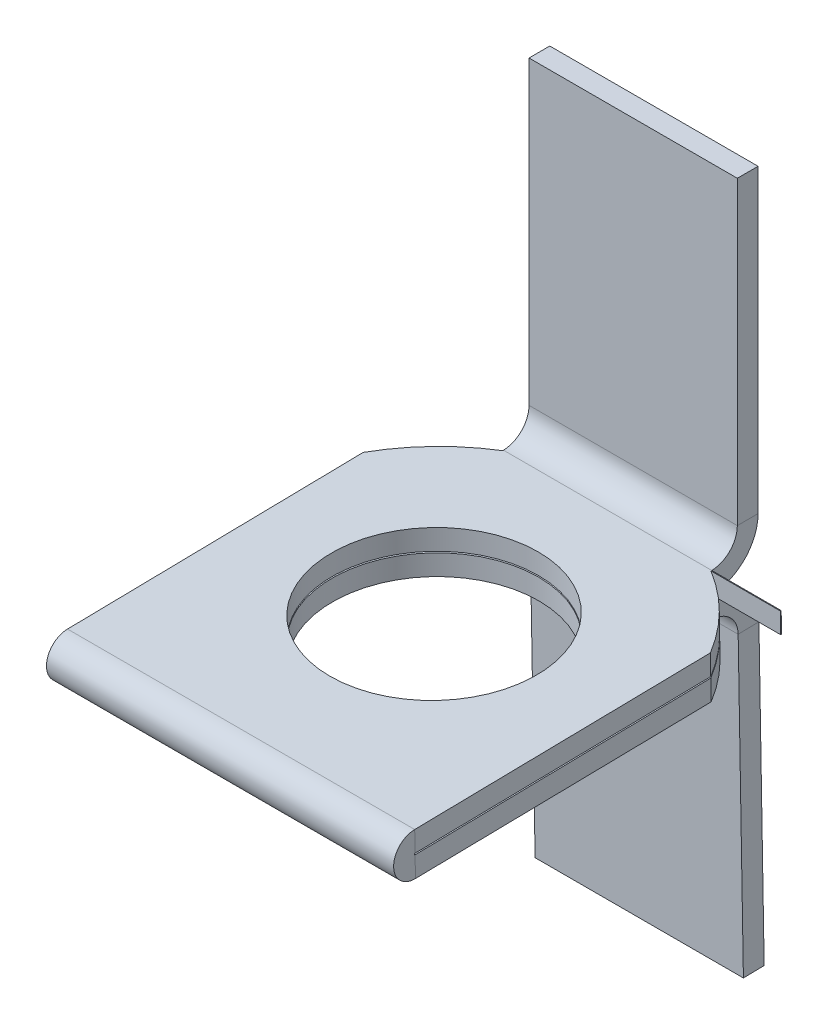
ISO-10303-21;
HEADER;
FILE_DESCRIPTION(('STEP AP214'),'2;1');
FILE_NAME('part.step','',(''),(''),'','','');
FILE_SCHEMA(('AUTOMOTIVE_DESIGN { 1 0 10303 214 1 1 1 1 }'));
ENDSEC;
DATA;
#1=APPLICATION_CONTEXT('core data for automotive mechanical design processes');
#2=APPLICATION_PROTOCOL_DEFINITION('international standard','automotive_design',2000,#1);
#3=PRODUCT_CONTEXT('',#1,'mechanical');
#4=PRODUCT('Part','Part','',(#3));
#5=PRODUCT_RELATED_PRODUCT_CATEGORY('part','',(#4));
#6=PRODUCT_DEFINITION_FORMATION('','',#4);
#7=PRODUCT_DEFINITION_CONTEXT('part definition',#1,'design');
#8=PRODUCT_DEFINITION('design','',#6,#7);
#9=PRODUCT_DEFINITION_SHAPE('','',#8);
#10=(LENGTH_UNIT() NAMED_UNIT(*) SI_UNIT(.MILLI.,.METRE.));
#11=(NAMED_UNIT(*) PLANE_ANGLE_UNIT() SI_UNIT($,.RADIAN.));
#12=(NAMED_UNIT(*) SI_UNIT($,.STERADIAN.) SOLID_ANGLE_UNIT());
#13=UNCERTAINTY_MEASURE_WITH_UNIT(LENGTH_MEASURE(1.E-05),#10,'distance_accuracy_value','');
#14=(GEOMETRIC_REPRESENTATION_CONTEXT(3) GLOBAL_UNCERTAINTY_ASSIGNED_CONTEXT((#13)) GLOBAL_UNIT_ASSIGNED_CONTEXT((#10,
#11,#12)) REPRESENTATION_CONTEXT('',''));
#15=CARTESIAN_POINT('',(0.,0.,0.));
#16=DIRECTION('',(0.,0.,1.));
#17=DIRECTION('',(1.,0.,0.));
#18=AXIS2_PLACEMENT_3D('',#15,#16,#17);
#19=CARTESIAN_POINT('',(12.7,-13.2276010571627,30.2262443212151));
#20=DIRECTION('',(-1.,0.,0.));
#21=DIRECTION('',(0.,0.,1.));
#22=AXIS2_PLACEMENT_3D('',#19,#20,#21);
#23=PLANE('',#22);
#24=DIRECTION('',(0.,-0.017452406437287,0.999847695156391));
#25=VECTOR('',#24,1.);
#26=CARTESIAN_POINT('',(12.7,-12.6956690385854,-0.248120613246977));
#27=LINE('',#26,#25);
#28=CARTESIAN_POINT('',(12.7,-12.8225975510854,7.02360899772607));
#29=VERTEX_POINT('',#28);
#30=CARTESIAN_POINT('',(12.7,-13.2002196276552,28.6575632753303));
#31=VERTEX_POINT('',#30);
#32=EDGE_CURVE('E424',#29,#31,#27,.T.);
#33=ORIENTED_EDGE('',*,*,#32,.F.);
#34=DIRECTION('',(0.,-0.999847695156391,-0.017452406437287));
#35=VECTOR('',#34,1.);
#36=CARTESIAN_POINT('',(12.7,13.0970952517496,7.4760389185191));
#37=LINE('',#36,#35);
#38=CARTESIAN_POINT('',(12.7,-11.3039088899585,7.05011780691179));
#39=VERTEX_POINT('',#38);
#40=EDGE_CURVE('E571',#39,#29,#37,.T.);
#41=ORIENTED_EDGE('',*,*,#40,.F.);
#42=DIRECTION('',(0.,0.017452406437287,-0.999847695156391));
#43=VECTOR('',#42,1.);
#44=CARTESIAN_POINT('',(12.7,-11.7089123960358,30.2527531304008));
#45=LINE('',#44,#43);
#46=CARTESIAN_POINT('',(12.7,-11.6815309665282,28.6840720845159));
#47=VERTEX_POINT('',#46);
#48=EDGE_CURVE('E322',#39,#47,#45,.F.);
#49=ORIENTED_EDGE('',*,*,#48,.T.);
#50=DIRECTION('',(0.,0.999847695156392,0.017452406437246));
#51=VECTOR('',#50,1.);
#52=CARTESIAN_POINT('',(12.7,-13.2002196276552,28.6575632753303));
#53=LINE('',#52,#51);
#54=EDGE_CURVE('E492',#31,#47,#53,.T.);
#55=ORIENTED_EDGE('',*,*,#54,.F.);
#56=EDGE_LOOP('',(#33,#41,#49,#55));
#57=FACE_BOUND('',#56,.T.);
#58=ADVANCED_FACE('F84',(#57),#23,.F.);
#59=CARTESIAN_POINT('',(-7.61999999999999,-16.2566260861431,1.84297763630703));
#60=DIRECTION('',(-1.,0.,0.));
#61=DIRECTION('',(0.,0.,1.));
#62=AXIS2_PLACEMENT_3D('',#59,#60,#61);
#63=PLANE('',#62);
#64=CARTESIAN_POINT('',(-7.61999999999999,-16.2566260861431,1.84297763630703));
#65=DIRECTION('',(1.,0.,0.));
#66=DIRECTION('',(0.,0.,-1.));
#67=AXIS2_PLACEMENT_3D('',#64,#65,#66);
#68=CIRCLE('',#67,3.42392);
#69=CARTESIAN_POINT('',(-7.61999999999999,-12.8327061245043,1.8434901702748));
#70=VERTEX_POINT('',#69);
#71=CARTESIAN_POINT('',(-7.61999999999999,-12.8332275657433,1.90273327975585));
#72=VERTEX_POINT('',#71);
#73=EDGE_CURVE('E386',#70,#72,#68,.T.);
#74=ORIENTED_EDGE('',*,*,#73,.F.);
#75=DIRECTION('',(0.,-0.999847695156391,-0.017452406437287));
#76=VECTOR('',#75,1.);
#77=CARTESIAN_POINT('',(-7.61999999999999,-16.2555921499672,1.78374347245845));
#78=LINE('',#77,#76);
#79=CARTESIAN_POINT('',(-7.61999999999999,-14.3518035687837,1.81697422575261));
#80=VERTEX_POINT('',#79);
#81=EDGE_CURVE('E13',#70,#80,#78,.T.);
#82=ORIENTED_EDGE('',*,*,#81,.T.);
#83=CARTESIAN_POINT('',(-7.61999999999999,-16.2566260861431,1.84297763630703));
#84=DIRECTION('',(-1.,0.,0.));
#85=DIRECTION('',(0.,0.,1.));
#86=AXIS2_PLACEMENT_3D('',#83,#84,#85);
#87=CIRCLE('',#86,1.905);
#88=CARTESIAN_POINT('',(-7.61999999999999,-14.3519162268702,1.8762244705701));
#89=VERTEX_POINT('',#88);
#90=EDGE_CURVE('E394',#80,#89,#87,.F.);
#91=ORIENTED_EDGE('',*,*,#90,.T.);
#92=DIRECTION('',(0.,-0.999847695156391,-0.017452406437287));
#93=VECTOR('',#92,1.);
#94=CARTESIAN_POINT('',(-7.61999999999999,-12.8332275657431,1.90273327975585));
#95=LINE('',#94,#93);
#96=EDGE_CURVE('E92',#72,#89,#95,.T.);
#97=ORIENTED_EDGE('',*,*,#96,.F.);
#98=EDGE_LOOP('',(#74,#82,#91,#97));
#99=FACE_BOUND('',#98,.T.);
#100=ADVANCED_FACE('F548',(#99),#63,.T.);
#101=CARTESIAN_POINT('',(12.7,-14.5555268208596,13.5410675878356));
#102=DIRECTION('',(-1.,0.,0.));
#103=DIRECTION('',(0.,0.017452406437287,-0.999847695156391));
#104=AXIS2_PLACEMENT_3D('',#101,#102,#103);
#105=PLANE('',#104);
#106=CARTESIAN_POINT('',(12.7,-12.922582320601,7.02186375708234));
#107=VERTEX_POINT('',#106);
#108=CARTESIAN_POINT('',(12.7,-14.441270981728,6.99535494789661));
#109=VERTEX_POINT('',#108);
#110=EDGE_CURVE('E569',#107,#109,#37,.T.);
#111=ORIENTED_EDGE('',*,*,#110,.F.);
#112=DIRECTION('',(0.,0.017452406437287,-0.999847695156391));
#113=VECTOR('',#112,1.);
#114=CARTESIAN_POINT('',(12.7,-13.0368381597327,13.5675763970213));
#115=LINE('',#114,#113);
#116=CARTESIAN_POINT('',(12.7,-13.3002043971708,28.6558180346866));
#117=VERTEX_POINT('',#116);
#118=EDGE_CURVE('E502',#117,#107,#115,.T.);
#119=ORIENTED_EDGE('',*,*,#118,.F.);
#120=DIRECTION('',(0.,-0.999847695156391,-0.017452406437287));
#121=VECTOR('',#120,1.);
#122=CARTESIAN_POINT('',(12.7,-14.8188930582977,28.6293092255009));
#123=LINE('',#122,#121);
#124=CARTESIAN_POINT('',(12.7,-14.8188930582977,28.6293092255006));
#125=VERTEX_POINT('',#124);
#126=EDGE_CURVE('E520',#117,#125,#123,.T.);
#127=ORIENTED_EDGE('',*,*,#126,.T.);
#128=DIRECTION('',(0.,0.017452406437287,-0.999847695156391));
#129=VECTOR('',#128,1.);
#130=CARTESIAN_POINT('',(12.7,-14.5555268208596,13.5410675878356));
#131=LINE('',#130,#129);
#132=EDGE_CURVE('E506',#125,#109,#131,.T.);
#133=ORIENTED_EDGE('',*,*,#132,.T.);
#134=EDGE_LOOP('',(#111,#119,#127,#133));
#135=FACE_BOUND('',#134,.T.);
#136=ADVANCED_FACE('F567',(#135),#105,.F.);
#137=CARTESIAN_POINT('',(0.,-14.5555268208596,13.5410675878355));
#138=DIRECTION('',(0.,-0.999847695156391,-0.017452406437287));
#139=DIRECTION('',(0.,0.017452406437287,-0.999847695156391));
#140=AXIS2_PLACEMENT_3D('',#137,#138,#139);
#141=PLANE('',#140);
#142=CARTESIAN_POINT('',(0.,-14.5725278524478,14.5150560352076));
#143=DIRECTION('',(0.,-0.999847695156391,-0.017452406437287));
#144=DIRECTION('',(0.,0.017452406437287,-0.999847695156391));
#145=AXIS2_PLACEMENT_3D('',#142,#143,#144);
#146=CIRCLE('',#145,14.7598486716029);
#147=CARTESIAN_POINT('',(-12.7,-14.441270981728,6.99535494789659));
#148=VERTEX_POINT('',#147);
#149=EDGE_CURVE('E308',#89,#148,#146,.F.);
#150=ORIENTED_EDGE('',*,*,#149,.F.);
#151=DIRECTION('',(-1.,0.,0.));
#152=VECTOR('',#151,1.);
#153=CARTESIAN_POINT('',(12.7,-14.3519162268702,1.87622447057007));
#154=LINE('',#153,#152);
#155=CARTESIAN_POINT('',(7.62000000000001,-14.3519162268702,1.8762244705701));
#156=VERTEX_POINT('',#155);
#157=EDGE_CURVE('E529',#156,#89,#154,.T.);
#158=ORIENTED_EDGE('',*,*,#157,.F.);
#159=CARTESIAN_POINT('',(0.,-14.5725278524478,14.5150560352076));
#160=DIRECTION('',(0.,-0.999847695156391,-0.017452406437287));
#161=DIRECTION('',(0.,0.017452406437287,-0.999847695156391));
#162=AXIS2_PLACEMENT_3D('',#159,#160,#161);
#163=CIRCLE('',#162,14.7598486716029);
#164=EDGE_CURVE('E332',#109,#156,#163,.F.);
#165=ORIENTED_EDGE('',*,*,#164,.F.);
#166=ORIENTED_EDGE('',*,*,#132,.F.);
#167=DIRECTION('',(1.,0.,0.));
#168=VECTOR('',#167,1.);
#169=CARTESIAN_POINT('',(0.,-14.8188930582977,28.6293092255009));
#170=LINE('',#169,#168);
#171=CARTESIAN_POINT('',(-12.7,-14.8188930582977,28.6293092255006));
#172=VERTEX_POINT('',#171);
#173=EDGE_CURVE('E518',#172,#125,#170,.T.);
#174=ORIENTED_EDGE('',*,*,#173,.F.);
#175=DIRECTION('',(0.,-0.017452406437287,0.999847695156391));
#176=VECTOR('',#175,1.);
#177=CARTESIAN_POINT('',(-12.7,-14.5555268208596,13.5410675878355));
#178=LINE('',#177,#176);
#179=EDGE_CURVE('E503',#148,#172,#178,.T.);
#180=ORIENTED_EDGE('',*,*,#179,.F.);
#181=EDGE_LOOP('',(#150,#158,#165,#166,#174,#180));
#182=FACE_BOUND('',#181,.T.);
#183=CARTESIAN_POINT('',(0.,-14.5725278524478,14.5150560352076));
#184=DIRECTION('',(0.,-0.999847695156391,-0.017452406437287));
#185=DIRECTION('',(0.,0.017452406437287,-0.999847695156391));
#186=AXIS2_PLACEMENT_3D('',#183,#184,#185);
#187=CIRCLE('',#186,7.62);
#188=CARTESIAN_POINT('',(0.,-14.4395405153957,6.89621659811591));
#189=VERTEX_POINT('',#188);
#190=EDGE_CURVE('E499',#189,#189,#187,.T.);
#191=ORIENTED_EDGE('',*,*,#190,.F.);
#192=EDGE_LOOP('',(#191));
#193=FACE_BOUND('',#192,.T.);
#194=ADVANCED_FACE('F543',(#182,#193),#141,.T.);
#195=CARTESIAN_POINT('',(0.,-13.0368381597327,13.5675763970213));
#196=DIRECTION('',(0.,-0.999847695156391,-0.017452406437287));
#197=DIRECTION('',(0.,0.017452406437287,-0.999847695156391));
#198=AXIS2_PLACEMENT_3D('',#195,#196,#197);
#199=PLANE('',#198);
#200=CARTESIAN_POINT('',(0.,-13.0538391913209,14.5415648443933));
#201=DIRECTION('',(0.,-0.999847695156391,-0.017452406437287));
#202=DIRECTION('',(0.,0.017452406437287,-0.999847695156391));
#203=AXIS2_PLACEMENT_3D('',#200,#201,#202);
#204=CIRCLE('',#203,7.62);
#205=CARTESIAN_POINT('',(0.,-12.9208518542687,6.92272540730164));
#206=VERTEX_POINT('',#205);
#207=EDGE_CURVE('E409',#206,#206,#204,.T.);
#208=ORIENTED_EDGE('',*,*,#207,.T.);
#209=EDGE_LOOP('',(#208));
#210=FACE_BOUND('',#209,.T.);
#211=DIRECTION('',(-1.,0.,0.));
#212=VECTOR('',#211,1.);
#213=CARTESIAN_POINT('',(12.7,-12.8332275657433,1.90273327975579));
#214=LINE('',#213,#212);
#215=CARTESIAN_POINT('',(7.62000000000001,-12.8332275657433,1.90273327975583));
#216=VERTEX_POINT('',#215);
#217=EDGE_CURVE('E523',#216,#72,#214,.T.);
#218=ORIENTED_EDGE('',*,*,#217,.T.);
#219=CARTESIAN_POINT('',(0.,-13.0538391913209,14.5415648443933));
#220=DIRECTION('',(0.,-0.999847695156391,-0.017452406437287));
#221=DIRECTION('',(0.,0.017452406437287,-0.999847695156391));
#222=AXIS2_PLACEMENT_3D('',#219,#220,#221);
#223=CIRCLE('',#222,14.7598486716029);
#224=CARTESIAN_POINT('',(-12.7,-12.922582320601,7.02186375708232));
#225=VERTEX_POINT('',#224);
#226=EDGE_CURVE('E344',#72,#225,#223,.F.);
#227=ORIENTED_EDGE('',*,*,#226,.T.);
#228=DIRECTION('',(0.,0.017452406437287,-0.999847695156391));
#229=VECTOR('',#228,1.);
#230=CARTESIAN_POINT('',(-12.7,-13.0368381597327,13.5675763970213));
#231=LINE('',#230,#229);
#232=CARTESIAN_POINT('',(-12.7,-13.3002043971708,28.6558180346866));
#233=VERTEX_POINT('',#232);
#234=EDGE_CURVE('E509',#225,#233,#231,.F.);
#235=ORIENTED_EDGE('',*,*,#234,.T.);
#236=DIRECTION('',(1.,0.,0.));
#237=VECTOR('',#236,1.);
#238=CARTESIAN_POINT('',(0.,-13.3002043971708,28.6558180346866));
#239=LINE('',#238,#237);
#240=EDGE_CURVE('E505',#233,#117,#239,.T.);
#241=ORIENTED_EDGE('',*,*,#240,.T.);
#242=ORIENTED_EDGE('',*,*,#118,.T.);
#243=CARTESIAN_POINT('',(0.,-13.0538391913209,14.5415648443933));
#244=DIRECTION('',(0.,-0.999847695156391,-0.017452406437287));
#245=DIRECTION('',(0.,0.017452406437287,-0.999847695156391));
#246=AXIS2_PLACEMENT_3D('',#243,#244,#245);
#247=CIRCLE('',#246,14.7598486716029);
#248=EDGE_CURVE('E324',#107,#216,#247,.F.);
#249=ORIENTED_EDGE('',*,*,#248,.T.);
#250=EDGE_LOOP('',(#218,#227,#235,#241,#242,#249));
#251=FACE_BOUND('',#250,.T.);
#252=ADVANCED_FACE('F563',(#210,#251),#199,.F.);
#253=CARTESIAN_POINT('',(-12.7,-14.5555268208596,13.5410675878355));
#254=DIRECTION('',(1.,0.,0.));
#255=DIRECTION('',(0.,-0.017452406437287,0.999847695156391));
#256=AXIS2_PLACEMENT_3D('',#253,#254,#255);
#257=PLANE('',#256);
#258=DIRECTION('',(0.,-0.999847695156391,-0.017452406437287));
#259=VECTOR('',#258,1.);
#260=CARTESIAN_POINT('',(-12.7,13.0970952517497,7.47603891851908));
#261=LINE('',#260,#259);
#262=EDGE_CURVE('E573',#225,#148,#261,.T.);
#263=ORIENTED_EDGE('',*,*,#262,.T.);
#264=ORIENTED_EDGE('',*,*,#179,.T.);
#265=DIRECTION('',(0.,-0.999847695156391,-0.017452406437287));
#266=VECTOR('',#265,1.);
#267=CARTESIAN_POINT('',(-12.7,-14.8188930582977,28.6293092255009));
#268=LINE('',#267,#266);
#269=EDGE_CURVE('E515',#233,#172,#268,.T.);
#270=ORIENTED_EDGE('',*,*,#269,.F.);
#271=ORIENTED_EDGE('',*,*,#234,.F.);
#272=EDGE_LOOP('',(#263,#264,#270,#271));
#273=FACE_BOUND('',#272,.T.);
#274=ADVANCED_FACE('F1002',(#273),#257,.F.);
#275=CARTESIAN_POINT('',(0.,-38.4764713832538,14.0978111488369));
#276=DIRECTION('',(0.,0.999847695156391,0.017452406437287));
#277=DIRECTION('',(0.,-0.017452406437287,0.999847695156391));
#278=AXIS2_PLACEMENT_3D('',#275,#276,#277);
#279=CYLINDRICAL_SURFACE('',#278,7.62);
#280=ORIENTED_EDGE('',*,*,#190,.T.);
#281=EDGE_LOOP('',(#280));
#282=FACE_BOUND('',#281,.T.);
#283=ORIENTED_EDGE('',*,*,#207,.F.);
#284=EDGE_LOOP('',(#283));
#285=FACE_BOUND('',#284,.T.);
#286=ADVANCED_FACE('F86',(#282,#285),#279,.F.);
#287=CARTESIAN_POINT('',(7.62,-13.4476307207564,-1.51892000000035));
#288=DIRECTION('',(-1.,0.,0.));
#289=DIRECTION('',(0.,0.,1.));
#290=AXIS2_PLACEMENT_3D('',#287,#288,#289);
#291=PLANE('',#290);
#292=DIRECTION('',(0.,0.,1.));
#293=VECTOR('',#292,1.);
#294=CARTESIAN_POINT('',(7.62,-9.30881033965216,-1.51892000000035));
#295=LINE('',#294,#293);
#296=CARTESIAN_POINT('',(7.62,-9.30881033965216,-1.51892000000035));
#297=VERTEX_POINT('',#296);
#298=CARTESIAN_POINT('',(7.62,-9.30881033965216,0.));
#299=VERTEX_POINT('',#298);
#300=EDGE_CURVE('E474',#297,#299,#295,.T.);
#301=ORIENTED_EDGE('',*,*,#300,.F.);
#302=DIRECTION('',(0.,-1.,0.));
#303=VECTOR('',#302,1.);
#304=CARTESIAN_POINT('',(7.62,-13.4476307207564,-1.51892000000035));
#305=LINE('',#304,#303);
#306=CARTESIAN_POINT('',(7.62,12.7,-1.51892000000035));
#307=VERTEX_POINT('',#306);
#308=EDGE_CURVE('E469',#307,#297,#305,.T.);
#309=ORIENTED_EDGE('',*,*,#308,.F.);
#310=DIRECTION('',(0.,0.,1.));
#311=VECTOR('',#310,1.);
#312=CARTESIAN_POINT('',(7.62,12.7,-1.51892000000035));
#313=LINE('',#312,#311);
#314=CARTESIAN_POINT('',(7.62,12.7,0.));
#315=VERTEX_POINT('',#314);
#316=EDGE_CURVE('E490',#307,#315,#313,.T.);
#317=ORIENTED_EDGE('',*,*,#316,.T.);
#318=DIRECTION('',(0.,-1.,0.));
#319=VECTOR('',#318,1.);
#320=CARTESIAN_POINT('',(7.62,9.525,0.));
#321=LINE('',#320,#319);
#322=EDGE_CURVE('E488',#315,#299,#321,.T.);
#323=ORIENTED_EDGE('',*,*,#322,.T.);
#324=EDGE_LOOP('',(#301,#309,#317,#323));
#325=FACE_BOUND('',#324,.T.);
#326=ADVANCED_FACE('F617',(#325),#291,.F.);
#327=CARTESIAN_POINT('',(-9.52499999999998,12.7,-1.51892));
#328=DIRECTION('',(0.,1.,0.));
#329=DIRECTION('',(0.,0.,1.));
#330=AXIS2_PLACEMENT_3D('',#327,#328,#329);
#331=PLANE('',#330);
#332=ORIENTED_EDGE('',*,*,#316,.F.);
#333=DIRECTION('',(-1.,0.,0.));
#334=VECTOR('',#333,1.);
#335=CARTESIAN_POINT('',(-9.52499999999998,12.7,-1.51892));
#336=LINE('',#335,#334);
#337=CARTESIAN_POINT('',(-7.62,12.7,-1.51892000000035));
#338=VERTEX_POINT('',#337);
#339=EDGE_CURVE('E485',#307,#338,#336,.T.);
#340=ORIENTED_EDGE('',*,*,#339,.T.);
#341=DIRECTION('',(0.,0.,1.));
#342=VECTOR('',#341,1.);
#343=CARTESIAN_POINT('',(-7.62,12.7,-1.51892000000035));
#344=LINE('',#343,#342);
#345=CARTESIAN_POINT('',(-7.62,12.7,0.));
#346=VERTEX_POINT('',#345);
#347=EDGE_CURVE('E482',#338,#346,#344,.T.);
#348=ORIENTED_EDGE('',*,*,#347,.T.);
#349=DIRECTION('',(-1.,0.,0.));
#350=VECTOR('',#349,1.);
#351=CARTESIAN_POINT('',(-9.52499999999998,12.7,0.));
#352=LINE('',#351,#350);
#353=EDGE_CURVE('E477',#315,#346,#352,.T.);
#354=ORIENTED_EDGE('',*,*,#353,.F.);
#355=EDGE_LOOP('',(#332,#340,#348,#354));
#356=FACE_BOUND('',#355,.T.);
#357=ADVANCED_FACE('F638',(#356),#331,.T.);
#358=CARTESIAN_POINT('',(-7.62,-13.4476307207564,-1.51892000000035));
#359=DIRECTION('',(1.,0.,0.));
#360=DIRECTION('',(0.,0.,-1.));
#361=AXIS2_PLACEMENT_3D('',#358,#359,#360);
#362=PLANE('',#361);
#363=DIRECTION('',(0.,0.,-1.));
#364=VECTOR('',#363,1.);
#365=CARTESIAN_POINT('',(-7.62,-9.30881033965216,0.));
#366=LINE('',#365,#364);
#367=CARTESIAN_POINT('',(-7.62,-9.30881033965216,0.));
#368=VERTEX_POINT('',#367);
#369=CARTESIAN_POINT('',(-7.62,-9.30881033965216,-1.51892));
#370=VERTEX_POINT('',#369);
#371=EDGE_CURVE('E455',#368,#370,#366,.T.);
#372=ORIENTED_EDGE('',*,*,#371,.F.);
#373=DIRECTION('',(0.,1.,0.));
#374=VECTOR('',#373,1.);
#375=CARTESIAN_POINT('',(-7.62,9.525,0.));
#376=LINE('',#375,#374);
#377=EDGE_CURVE('E480',#368,#346,#376,.T.);
#378=ORIENTED_EDGE('',*,*,#377,.T.);
#379=ORIENTED_EDGE('',*,*,#347,.F.);
#380=DIRECTION('',(0.,1.,0.));
#381=VECTOR('',#380,1.);
#382=CARTESIAN_POINT('',(-7.62,-13.4476307207564,-1.51892000000035));
#383=LINE('',#382,#381);
#384=EDGE_CURVE('E464',#370,#338,#383,.T.);
#385=ORIENTED_EDGE('',*,*,#384,.F.);
#386=EDGE_LOOP('',(#372,#378,#379,#385));
#387=FACE_BOUND('',#386,.T.);
#388=ADVANCED_FACE('F627',(#387),#362,.F.);
#389=CARTESIAN_POINT('',(-9.525,9.525,0.));
#390=DIRECTION('',(0.,0.,1.));
#391=DIRECTION('',(1.,0.,0.));
#392=AXIS2_PLACEMENT_3D('',#389,#390,#391);
#393=PLANE('',#392);
#394=ORIENTED_EDGE('',*,*,#322,.F.);
#395=ORIENTED_EDGE('',*,*,#353,.T.);
#396=ORIENTED_EDGE('',*,*,#377,.F.);
#397=DIRECTION('',(-1.,0.,0.));
#398=VECTOR('',#397,1.);
#399=CARTESIAN_POINT('',(12.7,-9.30881033965216,0.));
#400=LINE('',#399,#398);
#401=EDGE_CURVE('E449',#299,#368,#400,.T.);
#402=ORIENTED_EDGE('',*,*,#401,.F.);
#403=EDGE_LOOP('',(#394,#395,#396,#402));
#404=FACE_BOUND('',#403,.T.);
#405=ADVANCED_FACE('F623',(#404),#393,.T.);
#406=CARTESIAN_POINT('',(7.61999999999999,-9.30881033965216,1.905));
#407=DIRECTION('',(1.,0.,0.));
#408=DIRECTION('',(0.,1.,0.));
#409=AXIS2_PLACEMENT_3D('',#406,#407,#408);
#410=PLANE('',#409);
#411=ORIENTED_EDGE('',*,*,#300,.T.);
#412=CARTESIAN_POINT('',(7.61999999999999,-9.30881033965216,1.905));
#413=DIRECTION('',(-1.,0.,0.));
#414=DIRECTION('',(0.,0.,1.));
#415=AXIS2_PLACEMENT_3D('',#412,#413,#414);
#416=CIRCLE('',#415,1.905);
#417=CARTESIAN_POINT('',(7.62,-11.2135201989247,1.87175316573663));
#418=VERTEX_POINT('',#417);
#419=EDGE_CURVE('E471',#299,#418,#416,.T.);
#420=ORIENTED_EDGE('',*,*,#419,.T.);
#421=DIRECTION('',(0.,0.999847695156391,0.01745240643728));
#422=VECTOR('',#421,1.);
#423=CARTESIAN_POINT('',(7.62,-12.732208860052,1.84524435655091));
#424=LINE('',#423,#422);
#425=CARTESIAN_POINT('',(7.62,-12.732208860052,1.84524435655091));
#426=VERTEX_POINT('',#425);
#427=EDGE_CURVE('E440',#426,#418,#424,.T.);
#428=ORIENTED_EDGE('',*,*,#427,.F.);
#429=CARTESIAN_POINT('',(7.61999999999999,-9.30881033965216,1.905));
#430=DIRECTION('',(-1.,0.,0.));
#431=DIRECTION('',(0.,1.,0.));
#432=AXIS2_PLACEMENT_3D('',#429,#430,#431);
#433=CIRCLE('',#432,3.42392);
#434=EDGE_CURVE('E434',#297,#426,#433,.T.);
#435=ORIENTED_EDGE('',*,*,#434,.F.);
#436=EDGE_LOOP('',(#411,#420,#428,#435));
#437=FACE_BOUND('',#436,.T.);
#438=ADVANCED_FACE('F613',(#437),#410,.T.);
#439=CARTESIAN_POINT('',(-9.525,9.525,-1.51892));
#440=DIRECTION('',(0.,0.,1.));
#441=DIRECTION('',(1.,0.,0.));
#442=AXIS2_PLACEMENT_3D('',#439,#440,#441);
#443=PLANE('',#442);
#444=ORIENTED_EDGE('',*,*,#339,.F.);
#445=ORIENTED_EDGE('',*,*,#308,.T.);
#446=DIRECTION('',(-1.,0.,0.));
#447=VECTOR('',#446,1.);
#448=CARTESIAN_POINT('',(12.7,-9.30881033965216,-1.51892));
#449=LINE('',#448,#447);
#450=EDGE_CURVE('E467',#297,#370,#449,.T.);
#451=ORIENTED_EDGE('',*,*,#450,.T.);
#452=ORIENTED_EDGE('',*,*,#384,.T.);
#453=EDGE_LOOP('',(#444,#445,#451,#452));
#454=FACE_BOUND('',#453,.T.);
#455=ADVANCED_FACE('F636',(#454),#443,.F.);
#456=CARTESIAN_POINT('',(-7.62,-9.30881033965216,1.905));
#457=DIRECTION('',(-1.,0.,0.));
#458=DIRECTION('',(0.,-1.,0.));
#459=AXIS2_PLACEMENT_3D('',#456,#457,#458);
#460=PLANE('',#459);
#461=DIRECTION('',(0.,0.999847695156391,0.01745240643728));
#462=VECTOR('',#461,1.);
#463=CARTESIAN_POINT('',(-7.62,-12.732208860052,1.84524435655091));
#464=LINE('',#463,#462);
#465=CARTESIAN_POINT('',(-7.62,-12.7322088600517,1.84524435655093));
#466=VERTEX_POINT('',#465);
#467=CARTESIAN_POINT('',(-7.62,-11.2135201989247,1.87175316573666));
#468=VERTEX_POINT('',#467);
#469=EDGE_CURVE('E461',#466,#468,#464,.T.);
#470=ORIENTED_EDGE('',*,*,#469,.T.);
#471=CARTESIAN_POINT('',(-7.61999999999999,-9.30881033965216,1.905));
#472=DIRECTION('',(-1.,0.,0.));
#473=DIRECTION('',(0.,0.,1.));
#474=AXIS2_PLACEMENT_3D('',#471,#472,#473);
#475=CIRCLE('',#474,1.905);
#476=EDGE_CURVE('E458',#468,#368,#475,.F.);
#477=ORIENTED_EDGE('',*,*,#476,.T.);
#478=ORIENTED_EDGE('',*,*,#371,.T.);
#479=CARTESIAN_POINT('',(-7.62,-9.30881033965216,1.905));
#480=DIRECTION('',(1.,0.,0.));
#481=DIRECTION('',(0.,1.,0.));
#482=AXIS2_PLACEMENT_3D('',#479,#480,#481);
#483=CIRCLE('',#482,3.42392);
#484=EDGE_CURVE('E437',#466,#370,#483,.T.);
#485=ORIENTED_EDGE('',*,*,#484,.F.);
#486=EDGE_LOOP('',(#470,#477,#478,#485));
#487=FACE_BOUND('',#486,.T.);
#488=ADVANCED_FACE('F630',(#487),#460,.T.);
#489=CARTESIAN_POINT('',(15.8648842451953,-9.30881033965216,1.905));
#490=DIRECTION('',(-1.,0.,0.));
#491=DIRECTION('',(0.,0.,1.));
#492=AXIS2_PLACEMENT_3D('',#489,#490,#491);
#493=CYLINDRICAL_SURFACE('',#492,1.905);
#494=ORIENTED_EDGE('',*,*,#476,.F.);
#495=DIRECTION('',(1.,0.,0.));
#496=VECTOR('',#495,1.);
#497=CARTESIAN_POINT('',(-12.7,-11.2135201989247,1.87175316573663));
#498=LINE('',#497,#496);
#499=EDGE_CURVE('E452',#468,#418,#498,.T.);
#500=ORIENTED_EDGE('',*,*,#499,.T.);
#501=ORIENTED_EDGE('',*,*,#419,.F.);
#502=ORIENTED_EDGE('',*,*,#401,.T.);
#503=EDGE_LOOP('',(#494,#500,#501,#502));
#504=FACE_BOUND('',#503,.T.);
#505=ADVANCED_FACE('F612',(#504),#493,.F.);
#506=CARTESIAN_POINT('',(12.7,-12.732208860052,1.84524435655091));
#507=DIRECTION('',(0.,-0.01745240643728,0.999847695156391));
#508=DIRECTION('',(0.,-0.999847695156391,-0.01745240643728));
#509=AXIS2_PLACEMENT_3D('',#506,#507,#508);
#510=PLANE('',#509);
#511=DIRECTION('',(1.,0.,0.));
#512=VECTOR('',#511,1.);
#513=CARTESIAN_POINT('',(0.,-11.2135201989247,1.87175316573663));
#514=LINE('',#513,#512);
#515=CARTESIAN_POINT('',(12.7,-11.2135201989247,1.87175316573663));
#516=VERTEX_POINT('',#515);
#517=EDGE_CURVE('E447',#418,#516,#514,.T.);
#518=ORIENTED_EDGE('',*,*,#517,.T.);
#519=DIRECTION('',(0.,-0.999847695156391,-0.017452406437287));
#520=VECTOR('',#519,1.);
#521=CARTESIAN_POINT('',(12.7,-11.2135201989247,1.87175316573663));
#522=LINE('',#521,#520);
#523=CARTESIAN_POINT('',(12.7,-12.732208860052,1.84524435655091));
#524=VERTEX_POINT('',#523);
#525=EDGE_CURVE('E445',#516,#524,#522,.T.);
#526=ORIENTED_EDGE('',*,*,#525,.T.);
#527=DIRECTION('',(-1.,0.,0.));
#528=VECTOR('',#527,1.);
#529=CARTESIAN_POINT('',(-12.7,-12.7322088600517,1.84524435655091));
#530=LINE('',#529,#528);
#531=EDGE_CURVE('E443',#524,#426,#530,.T.);
#532=ORIENTED_EDGE('',*,*,#531,.T.);
#533=ORIENTED_EDGE('',*,*,#427,.T.);
#534=EDGE_LOOP('',(#518,#526,#532,#533));
#535=FACE_BOUND('',#534,.T.);
#536=ADVANCED_FACE('F606',(#535),#510,.F.);
#537=CARTESIAN_POINT('',(15.8648842451953,-9.30881033965216,1.905));
#538=DIRECTION('',(-1.,0.,0.));
#539=DIRECTION('',(0.,0.,1.));
#540=AXIS2_PLACEMENT_3D('',#537,#538,#539);
#541=CYLINDRICAL_SURFACE('',#540,3.42392);
#542=ORIENTED_EDGE('',*,*,#484,.T.);
#543=ORIENTED_EDGE('',*,*,#450,.F.);
#544=ORIENTED_EDGE('',*,*,#434,.T.);
#545=DIRECTION('',(-1.,0.,0.));
#546=VECTOR('',#545,1.);
#547=CARTESIAN_POINT('',(-12.7,-12.7322088600517,1.84524435655091));
#548=LINE('',#547,#546);
#549=EDGE_CURVE('E431',#426,#466,#548,.T.);
#550=ORIENTED_EDGE('',*,*,#549,.T.);
#551=EDGE_LOOP('',(#542,#543,#544,#550));
#552=FACE_BOUND('',#551,.T.);
#553=ADVANCED_FACE('F633',(#552),#541,.T.);
#554=CARTESIAN_POINT('',(0.,-38.4764713832538,14.0978111488369));
#555=DIRECTION('',(0.,0.999847695156391,0.0174524064372871));
#556=DIRECTION('',(0.,-0.0174524064372871,0.999847695156391));
#557=AXIS2_PLACEMENT_3D('',#554,#555,#556);
#558=CYLINDRICAL_SURFACE('',#557,7.62);
#559=CARTESIAN_POINT('',(0.,-11.4351657606783,14.5698188942228));
#560=DIRECTION('',(0.,0.999847695156391,0.0174524064372871));
#561=DIRECTION('',(0.,-0.0174524064372871,0.999847695156391));
#562=AXIS2_PLACEMENT_3D('',#559,#560,#561);
#563=CIRCLE('',#562,7.62);
#564=CARTESIAN_POINT('',(0.,-11.5681530977304,22.1886583313145));
#565=VERTEX_POINT('',#564);
#566=EDGE_CURVE('E428',#565,#565,#563,.T.);
#567=ORIENTED_EDGE('',*,*,#566,.T.);
#568=EDGE_LOOP('',(#567));
#569=FACE_BOUND('',#568,.T.);
#570=CARTESIAN_POINT('',(0.,-12.9538544218052,14.5433100850371));
#571=DIRECTION('',(0.,0.999847695156391,0.017452406437287));
#572=DIRECTION('',(0.,-0.017452406437287,0.999847695156391));
#573=AXIS2_PLACEMENT_3D('',#570,#571,#572);
#574=CIRCLE('',#573,7.62);
#575=CARTESIAN_POINT('',(0.,-13.0868417588574,22.1621495221288));
#576=VERTEX_POINT('',#575);
#577=EDGE_CURVE('E425',#576,#576,#574,.T.);
#578=ORIENTED_EDGE('',*,*,#577,.F.);
#579=EDGE_LOOP('',(#578));
#580=FACE_BOUND('',#579,.T.);
#581=ADVANCED_FACE('F671',(#569,#580),#558,.F.);
#582=CARTESIAN_POINT('',(0.,-12.6956690385854,-0.24812061324698));
#583=DIRECTION('',(0.,0.999847695156391,0.017452406437287));
#584=DIRECTION('',(0.,-0.017452406437287,0.999847695156391));
#585=AXIS2_PLACEMENT_3D('',#582,#583,#584);
#586=PLANE('',#585);
#587=ORIENTED_EDGE('',*,*,#577,.T.);
#588=EDGE_LOOP('',(#587));
#589=FACE_BOUND('',#588,.T.);
#590=DIRECTION('',(0.,0.017452406437287,-0.999847695156391));
#591=VECTOR('',#590,1.);
#592=CARTESIAN_POINT('',(-12.7,-12.6956690385854,-0.248120613246982));
#593=LINE('',#592,#591);
#594=CARTESIAN_POINT('',(-12.7,-13.2002196276551,28.6575632753303));
#595=VERTEX_POINT('',#594);
#596=CARTESIAN_POINT('',(-12.7,-12.8225975510854,7.02360899772605));
#597=VERTEX_POINT('',#596);
#598=EDGE_CURVE('E418',#595,#597,#593,.T.);
#599=ORIENTED_EDGE('',*,*,#598,.T.);
#600=CARTESIAN_POINT('',(0.,-12.9538544218052,14.5433100850371));
#601=DIRECTION('',(0.,0.999847695156391,0.017452406437287));
#602=DIRECTION('',(0.,-0.017452406437287,0.999847695156391));
#603=AXIS2_PLACEMENT_3D('',#600,#601,#602);
#604=CIRCLE('',#603,14.7598486716029);
#605=CARTESIAN_POINT('',(-7.62,-12.7332427962276,1.90447852039955));
#606=VERTEX_POINT('',#605);
#607=EDGE_CURVE('E341',#597,#606,#604,.F.);
#608=ORIENTED_EDGE('',*,*,#607,.T.);
#609=DIRECTION('',(0.,0.017452406437287,-0.999847695156391));
#610=VECTOR('',#609,1.);
#611=CARTESIAN_POINT('',(-7.62,-12.6956690385854,-0.24812061324698));
#612=LINE('',#611,#610);
#613=EDGE_CURVE('E336',#606,#466,#612,.T.);
#614=ORIENTED_EDGE('',*,*,#613,.T.);
#615=ORIENTED_EDGE('',*,*,#549,.F.);
#616=ORIENTED_EDGE('',*,*,#531,.F.);
#617=CARTESIAN_POINT('',(12.7,-12.7332427962276,1.90447852039956));
#618=VERTEX_POINT('',#617);
#619=EDGE_CURVE('E421',#524,#618,#27,.T.);
#620=ORIENTED_EDGE('',*,*,#619,.T.);
#621=DIRECTION('',(-1.,0.,0.));
#622=VECTOR('',#621,1.);
#623=CARTESIAN_POINT('',(0.,-12.7332427962276,1.90447852039956));
#624=LINE('',#623,#622);
#625=CARTESIAN_POINT('',(7.62000000000001,-12.7332427962276,1.90447852039956));
#626=VERTEX_POINT('',#625);
#627=EDGE_CURVE('E112',#618,#626,#624,.T.);
#628=ORIENTED_EDGE('',*,*,#627,.T.);
#629=CARTESIAN_POINT('',(0.,-12.9538544218052,14.5433100850371));
#630=DIRECTION('',(0.,0.999847695156391,0.017452406437287));
#631=DIRECTION('',(0.,-0.017452406437287,0.999847695156391));
#632=AXIS2_PLACEMENT_3D('',#629,#630,#631);
#633=CIRCLE('',#632,14.7598486716029);
#634=EDGE_CURVE('E315',#626,#29,#633,.F.);
#635=ORIENTED_EDGE('',*,*,#634,.T.);
#636=ORIENTED_EDGE('',*,*,#32,.T.);
#637=DIRECTION('',(1.,0.,0.));
#638=VECTOR('',#637,1.);
#639=CARTESIAN_POINT('',(-12.7,-13.2002196276551,28.6575632753303));
#640=LINE('',#639,#638);
#641=EDGE_CURVE('E403',#595,#31,#640,.T.);
#642=ORIENTED_EDGE('',*,*,#641,.F.);
#643=EDGE_LOOP('',(#599,#608,#614,#615,#616,#620,#628,#635,#636,#642));
#644=FACE_BOUND('',#643,.T.);
#645=ADVANCED_FACE('F585',(#589,#644),#586,.F.);
#646=CARTESIAN_POINT('',(-12.7,-12.6995372870141,-0.0265088091860582));
#647=DIRECTION('',(1.,0.,0.));
#648=DIRECTION('',(0.,0.,-1.));
#649=AXIS2_PLACEMENT_3D('',#646,#647,#648);
#650=PLANE('',#649);
#651=DIRECTION('',(0.,-0.017452406437287,0.999847695156391));
#652=VECTOR('',#651,1.);
#653=CARTESIAN_POINT('',(-12.7,-11.1808486258872,-3.34801630863524E-13));
#654=LINE('',#653,#652);
#655=CARTESIAN_POINT('',(-12.7,-11.6815309665282,28.684072084516));
#656=VERTEX_POINT('',#655);
#657=CARTESIAN_POINT('',(-12.7,-11.3039088899585,7.05011780691177));
#658=VERTEX_POINT('',#657);
#659=EDGE_CURVE('E412',#656,#658,#654,.F.);
#660=ORIENTED_EDGE('',*,*,#659,.T.);
#661=EDGE_CURVE('E326',#658,#597,#261,.T.);
#662=ORIENTED_EDGE('',*,*,#661,.T.);
#663=ORIENTED_EDGE('',*,*,#598,.F.);
#664=DIRECTION('',(0.,0.999847695156392,0.017452406437246));
#665=VECTOR('',#664,1.);
#666=CARTESIAN_POINT('',(-12.7,-13.2002196276551,28.6575632753303));
#667=LINE('',#666,#665);
#668=EDGE_CURVE('E415',#595,#656,#667,.T.);
#669=ORIENTED_EDGE('',*,*,#668,.T.);
#670=EDGE_LOOP('',(#660,#662,#663,#669));
#671=FACE_BOUND('',#670,.T.);
#672=ADVANCED_FACE('F580',(#671),#650,.F.);
#673=CARTESIAN_POINT('',(0.,-11.1769803774585,-0.221611804061257));
#674=DIRECTION('',(0.,0.999847695156391,0.017452406437287));
#675=DIRECTION('',(0.,-0.017452406437287,0.999847695156391));
#676=AXIS2_PLACEMENT_3D('',#673,#674,#675);
#677=PLANE('',#676);
#678=CARTESIAN_POINT('',(0.,-11.4351657606783,14.5698188942228));
#679=DIRECTION('',(0.,0.999847695156391,0.017452406437287));
#680=DIRECTION('',(0.,-0.017452406437287,0.999847695156391));
#681=AXIS2_PLACEMENT_3D('',#678,#679,#680);
#682=CIRCLE('',#681,14.7598486716029);
#683=CARTESIAN_POINT('',(-7.62,-11.2145541351007,1.93098732958527));
#684=VERTEX_POINT('',#683);
#685=EDGE_CURVE('E339',#658,#684,#682,.F.);
#686=ORIENTED_EDGE('',*,*,#685,.F.);
#687=ORIENTED_EDGE('',*,*,#659,.F.);
#688=DIRECTION('',(1.,0.,0.));
#689=VECTOR('',#688,1.);
#690=CARTESIAN_POINT('',(-12.7,-11.6815309665282,28.684072084516));
#691=LINE('',#690,#689);
#692=EDGE_CURVE('E410',#656,#47,#691,.T.);
#693=ORIENTED_EDGE('',*,*,#692,.T.);
#694=ORIENTED_EDGE('',*,*,#48,.F.);
#695=CARTESIAN_POINT('',(0.,-11.4351657606783,14.5698188942228));
#696=DIRECTION('',(0.,0.999847695156391,0.017452406437287));
#697=DIRECTION('',(0.,-0.017452406437287,0.999847695156391));
#698=AXIS2_PLACEMENT_3D('',#695,#696,#697);
#699=CIRCLE('',#698,14.7598486716029);
#700=CARTESIAN_POINT('',(7.62000000000001,-11.2145541351007,1.93098732958528));
#701=VERTEX_POINT('',#700);
#702=EDGE_CURVE('E312',#701,#39,#699,.F.);
#703=ORIENTED_EDGE('',*,*,#702,.F.);
#704=DIRECTION('',(-1.,0.,0.));
#705=VECTOR('',#704,1.);
#706=CARTESIAN_POINT('',(0.,-11.2145541351007,1.93098732958528));
#707=LINE('',#706,#705);
#708=CARTESIAN_POINT('',(12.7,-11.2145541351007,1.93098732958528));
#709=VERTEX_POINT('',#708);
#710=EDGE_CURVE('E299',#709,#701,#707,.T.);
#711=ORIENTED_EDGE('',*,*,#710,.F.);
#712=EDGE_CURVE('E407',#516,#709,#45,.F.);
#713=ORIENTED_EDGE('',*,*,#712,.F.);
#714=ORIENTED_EDGE('',*,*,#517,.F.);
#715=ORIENTED_EDGE('',*,*,#499,.F.);
#716=DIRECTION('',(0.,0.017452406437287,-0.999847695156391));
#717=VECTOR('',#716,1.);
#718=CARTESIAN_POINT('',(-7.62,-11.1769803774585,-0.221611804061257));
#719=LINE('',#718,#717);
#720=EDGE_CURVE('E334',#684,#468,#719,.T.);
#721=ORIENTED_EDGE('',*,*,#720,.F.);
#722=EDGE_LOOP('',(#686,#687,#693,#694,#703,#711,#713,#714,#715,#721));
#723=FACE_BOUND('',#722,.T.);
#724=ORIENTED_EDGE('',*,*,#566,.F.);
#725=EDGE_LOOP('',(#724));
#726=FACE_BOUND('',#725,.T.);
#727=ADVANCED_FACE('F319',(#723,#726),#677,.T.);
#728=ORIENTED_EDGE('',*,*,#712,.T.);
#729=DIRECTION('',(0.,-0.999847695156391,-0.017452406437287));
#730=VECTOR('',#729,1.);
#731=CARTESIAN_POINT('',(12.7,13.1864500066074,2.35690844119259));
#732=LINE('',#731,#730);
#733=EDGE_CURVE('E303',#709,#618,#732,.T.);
#734=ORIENTED_EDGE('',*,*,#733,.T.);
#735=ORIENTED_EDGE('',*,*,#619,.F.);
#736=ORIENTED_EDGE('',*,*,#525,.F.);
#737=EDGE_LOOP('',(#728,#734,#735,#736));
#738=FACE_BOUND('',#737,.T.);
#739=ADVANCED_FACE('F601',(#738),#23,.F.);
#740=CARTESIAN_POINT('',(-12.7,-13.250212012413,28.6566906550085));
#741=DIRECTION('',(1.,0.,0.));
#742=DIRECTION('',(0.,0.,-1.));
#743=AXIS2_PLACEMENT_3D('',#740,#741,#742);
#744=PLANE('',#743);
#745=ORIENTED_EDGE('',*,*,#269,.T.);
#746=CARTESIAN_POINT('',(-12.7,-13.250212012413,28.6566906550085));
#747=DIRECTION('',(-1.,0.,0.));
#748=DIRECTION('',(0.,-1.,0.));
#749=AXIS2_PLACEMENT_3D('',#746,#747,#748);
#750=CIRCLE('',#749,1.56892);
#751=EDGE_CURVE('E391',#172,#656,#750,.T.);
#752=ORIENTED_EDGE('',*,*,#751,.T.);
#753=ORIENTED_EDGE('',*,*,#668,.F.);
#754=CARTESIAN_POINT('',(-12.7,-13.250212012413,28.6566906550085));
#755=DIRECTION('',(-1.,0.,0.));
#756=DIRECTION('',(0.,0.,1.));
#757=AXIS2_PLACEMENT_3D('',#754,#755,#756);
#758=CIRCLE('',#757,0.0500000000000002);
#759=EDGE_CURVE('E397',#233,#595,#758,.T.);
#760=ORIENTED_EDGE('',*,*,#759,.F.);
#761=EDGE_LOOP('',(#745,#752,#753,#760));
#762=FACE_BOUND('',#761,.T.);
#763=ADVANCED_FACE('F657',(#762),#744,.F.);
#764=CARTESIAN_POINT('',(12.7,-13.250212012413,28.6566906550085));
#765=DIRECTION('',(-1.,0.,0.));
#766=DIRECTION('',(0.,0.,1.));
#767=AXIS2_PLACEMENT_3D('',#764,#765,#766);
#768=PLANE('',#767);
#769=CARTESIAN_POINT('',(12.7,-13.250212012413,28.6566906550085));
#770=DIRECTION('',(-1.,0.,0.));
#771=DIRECTION('',(0.,-1.,0.));
#772=AXIS2_PLACEMENT_3D('',#769,#770,#771);
#773=CIRCLE('',#772,1.56892);
#774=EDGE_CURVE('E401',#47,#125,#773,.F.);
#775=ORIENTED_EDGE('',*,*,#774,.T.);
#776=ORIENTED_EDGE('',*,*,#126,.F.);
#777=CARTESIAN_POINT('',(12.7,-13.250212012413,28.6566906550085));
#778=DIRECTION('',(1.,0.,0.));
#779=DIRECTION('',(0.,0.,-1.));
#780=AXIS2_PLACEMENT_3D('',#777,#778,#779);
#781=CIRCLE('',#780,0.0500000000000002);
#782=EDGE_CURVE('E400',#31,#117,#781,.T.);
#783=ORIENTED_EDGE('',*,*,#782,.F.);
#784=ORIENTED_EDGE('',*,*,#54,.T.);
#785=EDGE_LOOP('',(#775,#776,#783,#784));
#786=FACE_BOUND('',#785,.T.);
#787=ADVANCED_FACE('F593',(#786),#768,.F.);
#788=CARTESIAN_POINT('',(25.5774029217345,-13.250212012413,28.6566906550085));
#789=DIRECTION('',(-1.,0.,0.));
#790=DIRECTION('',(0.,-1.,0.));
#791=AXIS2_PLACEMENT_3D('',#788,#789,#790);
#792=CYLINDRICAL_SURFACE('',#791,0.05);
#793=ORIENTED_EDGE('',*,*,#641,.T.);
#794=ORIENTED_EDGE('',*,*,#782,.T.);
#795=ORIENTED_EDGE('',*,*,#240,.F.);
#796=ORIENTED_EDGE('',*,*,#759,.T.);
#797=EDGE_LOOP('',(#793,#794,#795,#796));
#798=FACE_BOUND('',#797,.T.);
#799=ADVANCED_FACE('F589',(#798),#792,.F.);
#800=CARTESIAN_POINT('',(25.5774029217345,-13.250212012413,28.6566906550085));
#801=DIRECTION('',(-1.,0.,0.));
#802=DIRECTION('',(0.,-1.,0.));
#803=AXIS2_PLACEMENT_3D('',#800,#801,#802);
#804=CYLINDRICAL_SURFACE('',#803,1.56892);
#805=ORIENTED_EDGE('',*,*,#692,.F.);
#806=ORIENTED_EDGE('',*,*,#751,.F.);
#807=ORIENTED_EDGE('',*,*,#173,.T.);
#808=ORIENTED_EDGE('',*,*,#774,.F.);
#809=EDGE_LOOP('',(#805,#806,#807,#808));
#810=FACE_BOUND('',#809,.T.);
#811=ADVANCED_FACE('F752',(#810),#804,.T.);
#812=CARTESIAN_POINT('',(7.62000000000001,-16.2566260861431,1.84297763630703));
#813=DIRECTION('',(1.,0.,0.));
#814=DIRECTION('',(0.,1.,0.));
#815=AXIS2_PLACEMENT_3D('',#812,#813,#814);
#816=PLANE('',#815);
#817=DIRECTION('',(0.,-0.999847695156391,-0.017452406437287));
#818=VECTOR('',#817,1.);
#819=CARTESIAN_POINT('',(7.62000000000001,-12.8332275657431,1.90273327975586));
#820=LINE('',#819,#818);
#821=EDGE_CURVE('E526',#216,#156,#820,.T.);
#822=ORIENTED_EDGE('',*,*,#821,.T.);
#823=CARTESIAN_POINT('',(7.62000000000001,-16.2566260861431,1.84297763630703));
#824=DIRECTION('',(-1.,0.,0.));
#825=DIRECTION('',(0.,0.,1.));
#826=AXIS2_PLACEMENT_3D('',#823,#824,#825);
#827=CIRCLE('',#826,1.905);
#828=CARTESIAN_POINT('',(7.62000000000001,-16.22337925188,-0.0617322229657206));
#829=VERTEX_POINT('',#828);
#830=EDGE_CURVE('E352',#156,#829,#827,.T.);
#831=ORIENTED_EDGE('',*,*,#830,.T.);
#832=DIRECTION('',(0.,0.017452406437279,-0.999847695156391));
#833=VECTOR('',#832,1.);
#834=CARTESIAN_POINT('',(7.62000000000001,-16.22337925188,-0.0617322229657206));
#835=LINE('',#834,#833);
#836=CARTESIAN_POINT('',(7.62000000000001,-16.1968704426943,-1.58042088409282));
#837=VERTEX_POINT('',#836);
#838=EDGE_CURVE('E372',#829,#837,#835,.T.);
#839=ORIENTED_EDGE('',*,*,#838,.T.);
#840=CARTESIAN_POINT('',(7.62000000000001,-16.2566260861431,1.84297763630703));
#841=DIRECTION('',(-1.,0.,0.));
#842=DIRECTION('',(0.,-1.,0.));
#843=AXIS2_PLACEMENT_3D('',#840,#841,#842);
#844=CIRCLE('',#843,3.42392);
#845=EDGE_CURVE('E383',#216,#837,#844,.T.);
#846=ORIENTED_EDGE('',*,*,#845,.F.);
#847=EDGE_LOOP('',(#822,#831,#839,#846));
#848=FACE_BOUND('',#847,.T.);
#849=ADVANCED_FACE('F555',(#848),#816,.T.);
#850=ORIENTED_EDGE('',*,*,#81,.F.);
#851=CARTESIAN_POINT('',(-7.61999999999999,-16.1968704426943,-1.58042088409284));
#852=VERTEX_POINT('',#851);
#853=EDGE_CURVE('E388',#852,#70,#68,.T.);
#854=ORIENTED_EDGE('',*,*,#853,.F.);
#855=DIRECTION('',(0.,-0.0174524064372836,0.999847695156391));
#856=VECTOR('',#855,1.);
#857=CARTESIAN_POINT('',(-7.61999999999999,-16.1968704426942,-1.58042088409283));
#858=LINE('',#857,#856);
#859=CARTESIAN_POINT('',(-7.61999999999999,-16.22337925188,-0.0617322229657224));
#860=VERTEX_POINT('',#859);
#861=EDGE_CURVE('E378',#852,#860,#858,.T.);
#862=ORIENTED_EDGE('',*,*,#861,.T.);
#863=EDGE_CURVE('E387',#860,#80,#87,.F.);
#864=ORIENTED_EDGE('',*,*,#863,.T.);
#865=EDGE_LOOP('',(#850,#854,#862,#864));
#866=FACE_BOUND('',#865,.T.);
#867=ADVANCED_FACE('F653',(#866),#63,.T.);
#868=CARTESIAN_POINT('',(15.8910471341239,-16.2566260861431,1.84297763630704));
#869=DIRECTION('',(-1.,0.,0.));
#870=DIRECTION('',(0.,0.,1.));
#871=AXIS2_PLACEMENT_3D('',#868,#869,#870);
#872=CYLINDRICAL_SURFACE('',#871,3.42392);
#873=ORIENTED_EDGE('',*,*,#853,.T.);
#874=ORIENTED_EDGE('',*,*,#73,.T.);
#875=ORIENTED_EDGE('',*,*,#217,.F.);
#876=ORIENTED_EDGE('',*,*,#845,.T.);
#877=DIRECTION('',(-1.,0.,0.));
#878=VECTOR('',#877,1.);
#879=CARTESIAN_POINT('',(-12.7,-16.1968704426943,-1.58042088409268));
#880=LINE('',#879,#878);
#881=EDGE_CURVE('E349',#837,#852,#880,.T.);
#882=ORIENTED_EDGE('',*,*,#881,.T.);
#883=EDGE_LOOP('',(#873,#874,#875,#876,#882));
#884=FACE_BOUND('',#883,.T.);
#885=ADVANCED_FACE('F763',(#884),#872,.T.);
#886=CARTESIAN_POINT('',(15.8910471341239,-16.2566260861431,1.84297763630704));
#887=DIRECTION('',(-1.,0.,0.));
#888=DIRECTION('',(0.,0.,1.));
#889=AXIS2_PLACEMENT_3D('',#886,#887,#888);
#890=CYLINDRICAL_SURFACE('',#889,1.905);
#891=ORIENTED_EDGE('',*,*,#863,.F.);
#892=DIRECTION('',(1.,0.,0.));
#893=VECTOR('',#892,1.);
#894=CARTESIAN_POINT('',(-12.7,-16.22337925188,-0.0617322229657241));
#895=LINE('',#894,#893);
#896=EDGE_CURVE('E375',#860,#829,#895,.T.);
#897=ORIENTED_EDGE('',*,*,#896,.T.);
#898=ORIENTED_EDGE('',*,*,#830,.F.);
#899=ORIENTED_EDGE('',*,*,#157,.T.);
#900=ORIENTED_EDGE('',*,*,#90,.F.);
#901=EDGE_LOOP('',(#891,#897,#898,#899,#900));
#902=FACE_BOUND('',#901,.T.);
#903=ADVANCED_FACE('F552',(#902),#890,.F.);
#904=CARTESIAN_POINT('',(-12.7,-38.1696033792667,-1.96395636415109));
#905=DIRECTION('',(0.,0.999847695156391,0.0174524064372905));
#906=DIRECTION('',(0.,-0.0174524064372905,0.999847695156391));
#907=AXIS2_PLACEMENT_3D('',#904,#905,#906);
#908=PLANE('',#907);
#909=DIRECTION('',(-1.,0.,0.));
#910=VECTOR('',#909,1.);
#911=CARTESIAN_POINT('',(0.,-38.1696033792668,-1.96395636415108));
#912=LINE('',#911,#910);
#913=CARTESIAN_POINT('',(7.62000000000001,-38.1696033792668,-1.96395636415108));
#914=VERTEX_POINT('',#913);
#915=CARTESIAN_POINT('',(-7.61999999999999,-38.1696033792668,-1.96395636415109));
#916=VERTEX_POINT('',#915);
#917=EDGE_CURVE('E360',#914,#916,#912,.T.);
#918=ORIENTED_EDGE('',*,*,#917,.F.);
#919=DIRECTION('',(0.,-0.0174524064372835,0.999847695156391));
#920=VECTOR('',#919,1.);
#921=CARTESIAN_POINT('',(7.62000000000001,-38.1696033792668,-1.96395636415108));
#922=LINE('',#921,#920);
#923=CARTESIAN_POINT('',(7.62000000000001,-38.1961121884525,-0.445267703024058));
#924=VERTEX_POINT('',#923);
#925=EDGE_CURVE('E369',#914,#924,#922,.T.);
#926=ORIENTED_EDGE('',*,*,#925,.T.);
#927=DIRECTION('',(1.,0.,0.));
#928=VECTOR('',#927,1.);
#929=CARTESIAN_POINT('',(-12.7,-38.1961121884525,-0.44526770302415));
#930=LINE('',#929,#928);
#931=CARTESIAN_POINT('',(-7.61999999999999,-38.1961121884525,-0.445267703024149));
#932=VERTEX_POINT('',#931);
#933=EDGE_CURVE('E366',#924,#932,#930,.F.);
#934=ORIENTED_EDGE('',*,*,#933,.T.);
#935=DIRECTION('',(0.,-0.0174524064372835,0.999847695156391));
#936=VECTOR('',#935,1.);
#937=CARTESIAN_POINT('',(-7.61999999999999,-38.1696033792668,-1.96395636415109));
#938=LINE('',#937,#936);
#939=EDGE_CURVE('E353',#916,#932,#938,.T.);
#940=ORIENTED_EDGE('',*,*,#939,.F.);
#941=EDGE_LOOP('',(#918,#926,#934,#940));
#942=FACE_BOUND('',#941,.T.);
#943=ADVANCED_FACE('F781',(#942),#908,.F.);
#944=CARTESIAN_POINT('',(0.,0.0226445987925109,-1.29730819593921));
#945=DIRECTION('',(0.,-0.0174524064372905,0.999847695156391));
#946=DIRECTION('',(0.,-0.999847695156391,-0.0174524064372905));
#947=AXIS2_PLACEMENT_3D('',#944,#945,#946);
#948=PLANE('',#947);
#949=ORIENTED_EDGE('',*,*,#881,.F.);
#950=DIRECTION('',(0.,-0.999847695156391,-0.0174524064372835));
#951=VECTOR('',#950,1.);
#952=CARTESIAN_POINT('',(7.62000000000001,-12.0121839069166,-1.50737690890659));
#953=LINE('',#952,#951);
#954=EDGE_CURVE('E363',#837,#914,#953,.T.);
#955=ORIENTED_EDGE('',*,*,#954,.T.);
#956=ORIENTED_EDGE('',*,*,#917,.T.);
#957=DIRECTION('',(0.,0.999847695156391,0.0174524064372835));
#958=VECTOR('',#957,1.);
#959=CARTESIAN_POINT('',(-7.61999999999999,-12.0121839069166,-1.50737690890659));
#960=LINE('',#959,#958);
#961=EDGE_CURVE('E357',#916,#852,#960,.T.);
#962=ORIENTED_EDGE('',*,*,#961,.T.);
#963=EDGE_LOOP('',(#949,#955,#956,#962));
#964=FACE_BOUND('',#963,.T.);
#965=ADVANCED_FACE('F884',(#964),#948,.F.);
#966=CARTESIAN_POINT('',(7.62000000000001,-12.0121839069166,-1.50737690890659));
#967=DIRECTION('',(-1.,0.,0.));
#968=DIRECTION('',(0.,-0.999847695156391,-0.0174524064372835));
#969=AXIS2_PLACEMENT_3D('',#966,#967,#968);
#970=PLANE('',#969);
#971=ORIENTED_EDGE('',*,*,#838,.F.);
#972=DIRECTION('',(0.,-0.999847695156391,-0.0174524064372905));
#973=VECTOR('',#972,1.);
#974=CARTESIAN_POINT('',(7.62000000000001,-0.00386421039322814,0.221380465187744));
#975=LINE('',#974,#973);
#976=EDGE_CURVE('E355',#829,#924,#975,.T.);
#977=ORIENTED_EDGE('',*,*,#976,.T.);
#978=ORIENTED_EDGE('',*,*,#925,.F.);
#979=ORIENTED_EDGE('',*,*,#954,.F.);
#980=EDGE_LOOP('',(#971,#977,#978,#979));
#981=FACE_BOUND('',#980,.T.);
#982=ADVANCED_FACE('F874',(#981),#970,.F.);
#983=CARTESIAN_POINT('',(0.,-0.00386421039322467,0.221380465187744));
#984=DIRECTION('',(0.,-0.0174524064372905,0.999847695156391));
#985=DIRECTION('',(0.,-0.999847695156391,-0.0174524064372905));
#986=AXIS2_PLACEMENT_3D('',#983,#984,#985);
#987=PLANE('',#986);
#988=ORIENTED_EDGE('',*,*,#976,.F.);
#989=ORIENTED_EDGE('',*,*,#896,.F.);
#990=DIRECTION('',(0.,0.999847695156391,0.0174524064372905));
#991=VECTOR('',#990,1.);
#992=CARTESIAN_POINT('',(-7.61999999999999,-0.0038642103932212,0.221380465187744));
#993=LINE('',#992,#991);
#994=EDGE_CURVE('E350',#932,#860,#993,.T.);
#995=ORIENTED_EDGE('',*,*,#994,.F.);
#996=ORIENTED_EDGE('',*,*,#933,.F.);
#997=EDGE_LOOP('',(#988,#989,#995,#996));
#998=FACE_BOUND('',#997,.T.);
#999=ADVANCED_FACE('F865',(#998),#987,.T.);
#1000=CARTESIAN_POINT('',(-7.61999999999999,-12.0121839069166,-1.50737690890659));
#1001=DIRECTION('',(1.,0.,0.));
#1002=DIRECTION('',(0.,0.999847695156391,0.0174524064372835));
#1003=AXIS2_PLACEMENT_3D('',#1000,#1001,#1002);
#1004=PLANE('',#1003);
#1005=ORIENTED_EDGE('',*,*,#861,.F.);
#1006=ORIENTED_EDGE('',*,*,#961,.F.);
#1007=ORIENTED_EDGE('',*,*,#939,.T.);
#1008=ORIENTED_EDGE('',*,*,#994,.T.);
#1009=EDGE_LOOP('',(#1005,#1006,#1007,#1008));
#1010=FACE_BOUND('',#1009,.T.);
#1011=ADVANCED_FACE('F792',(#1010),#1004,.F.);
#1012=CARTESIAN_POINT('',(0.,12.9658383810298,14.9957400058301));
#1013=DIRECTION('',(0.,-0.999847695156391,-0.017452406437287));
#1014=DIRECTION('',(0.,0.017452406437287,-0.999847695156391));
#1015=AXIS2_PLACEMENT_3D('',#1012,#1013,#1014);
#1016=CYLINDRICAL_SURFACE('',#1015,14.7598486716029);
#1017=ORIENTED_EDGE('',*,*,#149,.T.);
#1018=ORIENTED_EDGE('',*,*,#262,.F.);
#1019=ORIENTED_EDGE('',*,*,#226,.F.);
#1020=ORIENTED_EDGE('',*,*,#96,.T.);
#1021=EDGE_LOOP('',(#1017,#1018,#1019,#1020));
#1022=FACE_BOUND('',#1021,.T.);
#1023=ADVANCED_FACE('F534',(#1022),#1016,.T.);
#1024=CARTESIAN_POINT('',(0.,12.9658383810298,14.9957400058301));
#1025=DIRECTION('',(0.,-0.999847695156391,-0.017452406437287));
#1026=DIRECTION('',(0.,0.017452406437287,-0.999847695156391));
#1027=AXIS2_PLACEMENT_3D('',#1024,#1025,#1026);
#1028=CYLINDRICAL_SURFACE('',#1027,14.7598486716029);
#1029=ORIENTED_EDGE('',*,*,#164,.T.);
#1030=ORIENTED_EDGE('',*,*,#821,.F.);
#1031=ORIENTED_EDGE('',*,*,#248,.F.);
#1032=ORIENTED_EDGE('',*,*,#110,.T.);
#1033=EDGE_LOOP('',(#1029,#1030,#1031,#1032));
#1034=FACE_BOUND('',#1033,.T.);
#1035=ADVANCED_FACE('F560',(#1034),#1028,.T.);
#1036=CARTESIAN_POINT('',(7.62000000000001,13.1864500066074,2.35690844119259));
#1037=DIRECTION('',(0.,0.017452406437287,-0.999847695156391));
#1038=DIRECTION('',(0.,0.999847695156391,0.017452406437287));
#1039=AXIS2_PLACEMENT_3D('',#1036,#1037,#1038);
#1040=PLANE('',#1039);
#1041=ORIENTED_EDGE('',*,*,#733,.F.);
#1042=ORIENTED_EDGE('',*,*,#710,.T.);
#1043=DIRECTION('',(0.,-0.999847695156391,-0.017452406437287));
#1044=VECTOR('',#1043,1.);
#1045=CARTESIAN_POINT('',(7.62000000000001,13.1864500066074,2.35690844119259));
#1046=LINE('',#1045,#1044);
#1047=EDGE_CURVE('E302',#701,#626,#1046,.T.);
#1048=ORIENTED_EDGE('',*,*,#1047,.T.);
#1049=ORIENTED_EDGE('',*,*,#627,.F.);
#1050=EDGE_LOOP('',(#1041,#1042,#1048,#1049));
#1051=FACE_BOUND('',#1050,.T.);
#1052=ADVANCED_FACE('F301',(#1051),#1040,.F.);
#1053=ORIENTED_EDGE('',*,*,#1047,.F.);
#1054=ORIENTED_EDGE('',*,*,#702,.T.);
#1055=ORIENTED_EDGE('',*,*,#40,.T.);
#1056=ORIENTED_EDGE('',*,*,#634,.F.);
#1057=EDGE_LOOP('',(#1053,#1054,#1055,#1056));
#1058=FACE_BOUND('',#1057,.T.);
#1059=ADVANCED_FACE('F311',(#1058),#1028,.T.);
#1060=ORIENTED_EDGE('',*,*,#661,.F.);
#1061=ORIENTED_EDGE('',*,*,#685,.T.);
#1062=DIRECTION('',(0.,-0.999847695156391,-0.017452406437287));
#1063=VECTOR('',#1062,1.);
#1064=CARTESIAN_POINT('',(-7.61999999999999,13.1864500066074,2.35690844119258));
#1065=LINE('',#1064,#1063);
#1066=EDGE_CURVE('E101',#684,#606,#1065,.T.);
#1067=ORIENTED_EDGE('',*,*,#1066,.T.);
#1068=ORIENTED_EDGE('',*,*,#607,.F.);
#1069=EDGE_LOOP('',(#1060,#1061,#1067,#1068));
#1070=FACE_BOUND('',#1069,.T.);
#1071=ADVANCED_FACE('F794',(#1070),#1016,.T.);
#1072=CARTESIAN_POINT('',(-7.61999999999999,13.1874839427834,2.29767427734396));
#1073=DIRECTION('',(1.,0.,0.));
#1074=DIRECTION('',(0.,1.,0.));
#1075=AXIS2_PLACEMENT_3D('',#1072,#1073,#1074);
#1076=PLANE('',#1075);
#1077=ORIENTED_EDGE('',*,*,#1066,.F.);
#1078=ORIENTED_EDGE('',*,*,#720,.T.);
#1079=ORIENTED_EDGE('',*,*,#469,.F.);
#1080=ORIENTED_EDGE('',*,*,#613,.F.);
#1081=EDGE_LOOP('',(#1077,#1078,#1079,#1080));
#1082=FACE_BOUND('',#1081,.T.);
#1083=ADVANCED_FACE('F631',(#1082),#1076,.F.);
#1084=CLOSED_SHELL('',(#58,#100,#136,#194,#252,#274,#286,#326,#357,#388,#405,#438,#455,#488,
#505,#536,#553,#581,#645,#672,#727,#739,#763,#787,#799,#811,#849,#867,#885,#903,#943,#965,#982,
#999,#1011,#1023,#1035,#1052,#1059,#1071,#1083));
#1085=MANIFOLD_SOLID_BREP('B2',#1084);
#1086=ADVANCED_BREP_SHAPE_REPRESENTATION('',(#18,#1085),#14);
#1087=SHAPE_DEFINITION_REPRESENTATION(#9,#1086);
ENDSEC;
END-ISO-10303-21;
